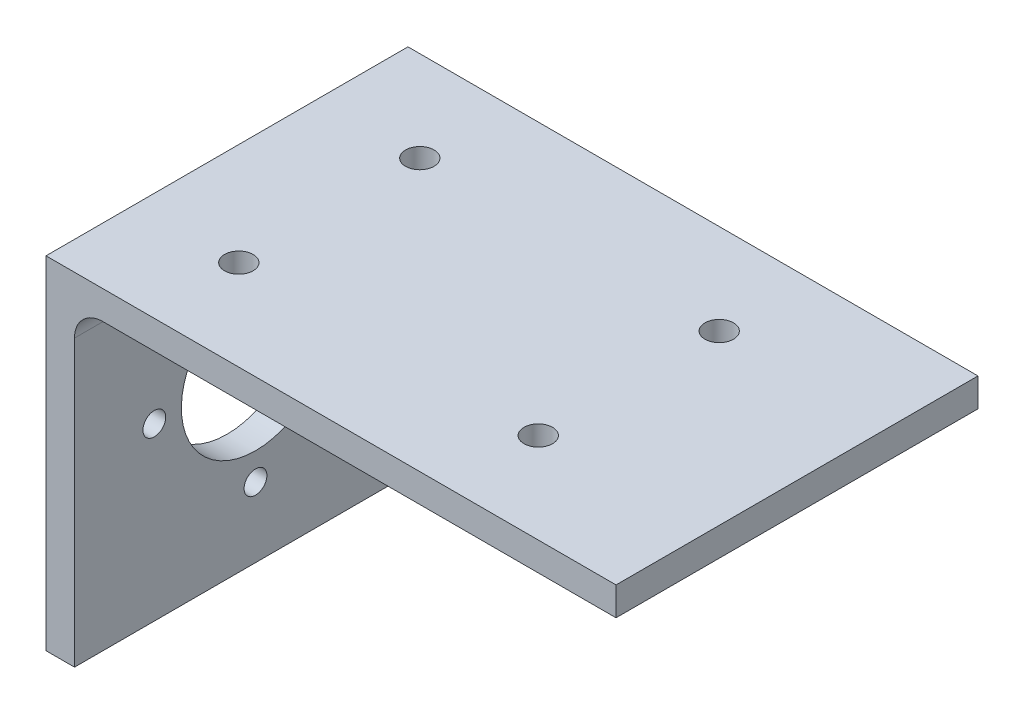
ISO-10303-21;
HEADER;
FILE_DESCRIPTION(('STEP AP214'),'2;1');
FILE_NAME('part.step','',(''),(''),'','','');
FILE_SCHEMA(('AUTOMOTIVE_DESIGN { 1 0 10303 214 1 1 1 1 }'));
ENDSEC;
DATA;
#1=APPLICATION_CONTEXT('core data for automotive mechanical design processes');
#2=APPLICATION_PROTOCOL_DEFINITION('international standard','automotive_design',2000,#1);
#3=PRODUCT_CONTEXT('',#1,'mechanical');
#4=PRODUCT('Part','Part','',(#3));
#5=PRODUCT_RELATED_PRODUCT_CATEGORY('part','',(#4));
#6=PRODUCT_DEFINITION_FORMATION('','',#4);
#7=PRODUCT_DEFINITION_CONTEXT('part definition',#1,'design');
#8=PRODUCT_DEFINITION('design','',#6,#7);
#9=PRODUCT_DEFINITION_SHAPE('','',#8);
#10=(LENGTH_UNIT() NAMED_UNIT(*) SI_UNIT(.MILLI.,.METRE.));
#11=(NAMED_UNIT(*) PLANE_ANGLE_UNIT() SI_UNIT($,.RADIAN.));
#12=(NAMED_UNIT(*) SI_UNIT($,.STERADIAN.) SOLID_ANGLE_UNIT());
#13=UNCERTAINTY_MEASURE_WITH_UNIT(LENGTH_MEASURE(1.E-05),#10,'distance_accuracy_value','');
#14=(GEOMETRIC_REPRESENTATION_CONTEXT(3) GLOBAL_UNCERTAINTY_ASSIGNED_CONTEXT((#13)) GLOBAL_UNIT_ASSIGNED_CONTEXT((#10,
#11,#12)) REPRESENTATION_CONTEXT('',''));
#15=CARTESIAN_POINT('',(0.,0.,0.));
#16=DIRECTION('',(0.,0.,1.));
#17=DIRECTION('',(1.,0.,0.));
#18=AXIS2_PLACEMENT_3D('',#15,#16,#17);
#19=CARTESIAN_POINT('',(5.,0.,63.5));
#20=DIRECTION('',(0.,1.,0.));
#21=DIRECTION('',(0.,0.,1.));
#22=AXIS2_PLACEMENT_3D('',#19,#20,#21);
#23=PLANE('',#22);
#24=DIRECTION('',(1.,0.,0.));
#25=VECTOR('',#24,1.);
#26=CARTESIAN_POINT('',(5.,0.,0.));
#27=LINE('',#26,#25);
#28=CARTESIAN_POINT('',(0.,0.,0.));
#29=VERTEX_POINT('',#28);
#30=CARTESIAN_POINT('',(5.,0.,0.));
#31=VERTEX_POINT('',#30);
#32=EDGE_CURVE('E123',#29,#31,#27,.T.);
#33=ORIENTED_EDGE('',*,*,#32,.T.);
#34=DIRECTION('',(0.,0.,-1.));
#35=VECTOR('',#34,1.);
#36=CARTESIAN_POINT('',(5.,0.,63.5));
#37=LINE('',#36,#35);
#38=CARTESIAN_POINT('',(5.,0.,63.5));
#39=VERTEX_POINT('',#38);
#40=EDGE_CURVE('E11',#39,#31,#37,.T.);
#41=ORIENTED_EDGE('',*,*,#40,.F.);
#42=DIRECTION('',(1.,0.,0.));
#43=VECTOR('',#42,1.);
#44=CARTESIAN_POINT('',(5.,0.,63.5));
#45=LINE('',#44,#43);
#46=CARTESIAN_POINT('',(0.,0.,63.5));
#47=VERTEX_POINT('',#46);
#48=EDGE_CURVE('E136',#47,#39,#45,.T.);
#49=ORIENTED_EDGE('',*,*,#48,.F.);
#50=DIRECTION('',(0.,0.,-1.));
#51=VECTOR('',#50,1.);
#52=CARTESIAN_POINT('',(0.,0.,63.5));
#53=LINE('',#52,#51);
#54=EDGE_CURVE('E119',#47,#29,#53,.T.);
#55=ORIENTED_EDGE('',*,*,#54,.T.);
#56=EDGE_LOOP('',(#33,#41,#49,#55));
#57=FACE_BOUND('',#56,.T.);
#58=ADVANCED_FACE('F33',(#57),#23,.F.);
#59=CARTESIAN_POINT('',(4.99999999999999,50.,63.5));
#60=DIRECTION('',(-1.,0.,0.));
#61=DIRECTION('',(0.,-1.,0.));
#62=AXIS2_PLACEMENT_3D('',#59,#60,#61);
#63=PLANE('',#62);
#64=CARTESIAN_POINT('',(5.,30.,49.5));
#65=DIRECTION('',(-1.,0.,0.));
#66=DIRECTION('',(0.,-1.,0.));
#67=AXIS2_PLACEMENT_3D('',#64,#65,#66);
#68=CIRCLE('',#67,2.);
#69=CARTESIAN_POINT('',(5.,28.,49.5));
#70=VERTEX_POINT('',#69);
#71=EDGE_CURVE('E162',#70,#70,#68,.T.);
#72=ORIENTED_EDGE('',*,*,#71,.T.);
#73=EDGE_LOOP('',(#72));
#74=FACE_BOUND('',#73,.T.);
#75=CARTESIAN_POINT('',(5.,12.25,31.75));
#76=DIRECTION('',(-1.,0.,0.));
#77=DIRECTION('',(0.,-1.,0.));
#78=AXIS2_PLACEMENT_3D('',#75,#76,#77);
#79=CIRCLE('',#78,2.00000000000001);
#80=CARTESIAN_POINT('',(5.,10.25,31.75));
#81=VERTEX_POINT('',#80);
#82=EDGE_CURVE('E168',#81,#81,#79,.T.);
#83=ORIENTED_EDGE('',*,*,#82,.T.);
#84=EDGE_LOOP('',(#83));
#85=FACE_BOUND('',#84,.T.);
#86=CARTESIAN_POINT('',(5.,30.,14.));
#87=DIRECTION('',(-1.,0.,0.));
#88=DIRECTION('',(0.,-1.,0.));
#89=AXIS2_PLACEMENT_3D('',#86,#87,#88);
#90=CIRCLE('',#89,2.00000000000001);
#91=CARTESIAN_POINT('',(5.,28.,14.));
#92=VERTEX_POINT('',#91);
#93=EDGE_CURVE('E169',#92,#92,#90,.T.);
#94=ORIENTED_EDGE('',*,*,#93,.T.);
#95=EDGE_LOOP('',(#94));
#96=FACE_BOUND('',#95,.T.);
#97=CARTESIAN_POINT('',(4.99999999999999,47.75,31.75));
#98=DIRECTION('',(-1.,0.,0.));
#99=DIRECTION('',(0.,-1.,0.));
#100=AXIS2_PLACEMENT_3D('',#97,#98,#99);
#101=CIRCLE('',#100,2.);
#102=CARTESIAN_POINT('',(4.99999999999999,45.75,31.75));
#103=VERTEX_POINT('',#102);
#104=EDGE_CURVE('E180',#103,#103,#101,.T.);
#105=ORIENTED_EDGE('',*,*,#104,.T.);
#106=EDGE_LOOP('',(#105));
#107=FACE_BOUND('',#106,.T.);
#108=CARTESIAN_POINT('',(5.,30.,31.75));
#109=DIRECTION('',(-1.,0.,0.));
#110=DIRECTION('',(0.,-1.,0.));
#111=AXIS2_PLACEMENT_3D('',#108,#109,#110);
#112=CIRCLE('',#111,13.);
#113=CARTESIAN_POINT('',(5.,17.,31.75));
#114=VERTEX_POINT('',#113);
#115=EDGE_CURVE('E127',#114,#114,#112,.T.);
#116=ORIENTED_EDGE('',*,*,#115,.T.);
#117=EDGE_LOOP('',(#116));
#118=FACE_BOUND('',#117,.T.);
#119=DIRECTION('',(0.,1.,0.));
#120=VECTOR('',#119,1.);
#121=CARTESIAN_POINT('',(4.99999999999999,50.,0.));
#122=LINE('',#121,#120);
#123=CARTESIAN_POINT('',(4.99999999999999,50.,0.));
#124=VERTEX_POINT('',#123);
#125=EDGE_CURVE('E126',#31,#124,#122,.T.);
#126=ORIENTED_EDGE('',*,*,#125,.T.);
#127=DIRECTION('',(0.,0.,-1.));
#128=VECTOR('',#127,1.);
#129=CARTESIAN_POINT('',(4.99999999999999,50.,63.5));
#130=LINE('',#129,#128);
#131=CARTESIAN_POINT('',(4.99999999999999,50.,63.5));
#132=VERTEX_POINT('',#131);
#133=EDGE_CURVE('E41',#132,#124,#130,.T.);
#134=ORIENTED_EDGE('',*,*,#133,.F.);
#135=DIRECTION('',(0.,1.,0.));
#136=VECTOR('',#135,1.);
#137=CARTESIAN_POINT('',(4.99999999999999,50.,63.5));
#138=LINE('',#137,#136);
#139=EDGE_CURVE('E89',#39,#132,#138,.T.);
#140=ORIENTED_EDGE('',*,*,#139,.F.);
#141=ORIENTED_EDGE('',*,*,#40,.T.);
#142=EDGE_LOOP('',(#126,#134,#140,#141));
#143=FACE_BOUND('',#142,.T.);
#144=ADVANCED_FACE('F238',(#74,#85,#96,#107,#118,#143),#63,.F.);
#145=CARTESIAN_POINT('',(9.99999999999998,50.,63.5));
#146=DIRECTION('',(0.,0.,-1.));
#147=DIRECTION('',(-1.,0.,0.));
#148=AXIS2_PLACEMENT_3D('',#145,#146,#147);
#149=CYLINDRICAL_SURFACE('',#148,4.99999999999999);
#150=CARTESIAN_POINT('',(9.99999999999998,50.,0.));
#151=DIRECTION('',(0.,0.,-1.));
#152=DIRECTION('',(1.,0.,0.));
#153=AXIS2_PLACEMENT_3D('',#150,#151,#152);
#154=CIRCLE('',#153,4.99999999999999);
#155=CARTESIAN_POINT('',(9.99999999999998,55.,0.));
#156=VERTEX_POINT('',#155);
#157=EDGE_CURVE('E129',#124,#156,#154,.T.);
#158=ORIENTED_EDGE('',*,*,#157,.T.);
#159=DIRECTION('',(0.,0.,-1.));
#160=VECTOR('',#159,1.);
#161=CARTESIAN_POINT('',(9.99999999999998,55.,63.5));
#162=LINE('',#161,#160);
#163=CARTESIAN_POINT('',(9.99999999999998,55.,63.5));
#164=VERTEX_POINT('',#163);
#165=EDGE_CURVE('E140',#164,#156,#162,.T.);
#166=ORIENTED_EDGE('',*,*,#165,.F.);
#167=CARTESIAN_POINT('',(9.99999999999998,50.,63.5));
#168=DIRECTION('',(0.,0.,-1.));
#169=DIRECTION('',(1.,0.,0.));
#170=AXIS2_PLACEMENT_3D('',#167,#168,#169);
#171=CIRCLE('',#170,4.99999999999999);
#172=EDGE_CURVE('E148',#132,#164,#171,.T.);
#173=ORIENTED_EDGE('',*,*,#172,.F.);
#174=ORIENTED_EDGE('',*,*,#133,.T.);
#175=EDGE_LOOP('',(#158,#166,#173,#174));
#176=FACE_BOUND('',#175,.T.);
#177=ADVANCED_FACE('F146',(#176),#149,.F.);
#178=CARTESIAN_POINT('',(100.,55.,63.5));
#179=DIRECTION('',(0.,1.,0.));
#180=DIRECTION('',(-1.,0.,0.));
#181=AXIS2_PLACEMENT_3D('',#178,#179,#180);
#182=PLANE('',#181);
#183=CARTESIAN_POINT('',(70.4798406497229,55.,15.875));
#184=DIRECTION('',(0.,1.,0.));
#185=DIRECTION('',(-1.,0.,0.));
#186=AXIS2_PLACEMENT_3D('',#183,#184,#185);
#187=CIRCLE('',#186,2.5);
#188=CARTESIAN_POINT('',(67.9798406497229,55.,15.875));
#189=VERTEX_POINT('',#188);
#190=EDGE_CURVE('E181',#189,#189,#187,.T.);
#191=ORIENTED_EDGE('',*,*,#190,.T.);
#192=EDGE_LOOP('',(#191));
#193=FACE_BOUND('',#192,.T.);
#194=CARTESIAN_POINT('',(17.9498406497229,55.,15.875));
#195=DIRECTION('',(0.,1.,0.));
#196=DIRECTION('',(-1.,0.,0.));
#197=AXIS2_PLACEMENT_3D('',#194,#195,#196);
#198=CIRCLE('',#197,2.5);
#199=CARTESIAN_POINT('',(15.4498406497229,55.,15.875));
#200=VERTEX_POINT('',#199);
#201=EDGE_CURVE('E191',#200,#200,#198,.T.);
#202=ORIENTED_EDGE('',*,*,#201,.T.);
#203=EDGE_LOOP('',(#202));
#204=FACE_BOUND('',#203,.T.);
#205=CARTESIAN_POINT('',(17.9498406497229,55.,47.625));
#206=DIRECTION('',(0.,1.,0.));
#207=DIRECTION('',(-1.,0.,0.));
#208=AXIS2_PLACEMENT_3D('',#205,#206,#207);
#209=CIRCLE('',#208,2.5);
#210=CARTESIAN_POINT('',(15.4498406497229,55.,47.625));
#211=VERTEX_POINT('',#210);
#212=EDGE_CURVE('E194',#211,#211,#209,.T.);
#213=ORIENTED_EDGE('',*,*,#212,.T.);
#214=EDGE_LOOP('',(#213));
#215=FACE_BOUND('',#214,.T.);
#216=CARTESIAN_POINT('',(70.4798406497229,55.,47.625));
#217=DIRECTION('',(0.,1.,0.));
#218=DIRECTION('',(-1.,0.,0.));
#219=AXIS2_PLACEMENT_3D('',#216,#217,#218);
#220=CIRCLE('',#219,2.5);
#221=CARTESIAN_POINT('',(67.9798406497229,55.,47.625));
#222=VERTEX_POINT('',#221);
#223=EDGE_CURVE('E197',#222,#222,#220,.T.);
#224=ORIENTED_EDGE('',*,*,#223,.T.);
#225=EDGE_LOOP('',(#224));
#226=FACE_BOUND('',#225,.T.);
#227=DIRECTION('',(1.,0.,0.));
#228=VECTOR('',#227,1.);
#229=CARTESIAN_POINT('',(100.,55.,0.));
#230=LINE('',#229,#228);
#231=CARTESIAN_POINT('',(100.,55.,0.));
#232=VERTEX_POINT('',#231);
#233=EDGE_CURVE('E131',#156,#232,#230,.T.);
#234=ORIENTED_EDGE('',*,*,#233,.T.);
#235=DIRECTION('',(0.,0.,-1.));
#236=VECTOR('',#235,1.);
#237=CARTESIAN_POINT('',(100.,55.,63.5));
#238=LINE('',#237,#236);
#239=CARTESIAN_POINT('',(100.,55.,63.5));
#240=VERTEX_POINT('',#239);
#241=EDGE_CURVE('E114',#240,#232,#238,.T.);
#242=ORIENTED_EDGE('',*,*,#241,.F.);
#243=DIRECTION('',(1.,0.,0.));
#244=VECTOR('',#243,1.);
#245=CARTESIAN_POINT('',(100.,55.,63.5));
#246=LINE('',#245,#244);
#247=EDGE_CURVE('E105',#164,#240,#246,.T.);
#248=ORIENTED_EDGE('',*,*,#247,.F.);
#249=ORIENTED_EDGE('',*,*,#165,.T.);
#250=EDGE_LOOP('',(#234,#242,#248,#249));
#251=FACE_BOUND('',#250,.T.);
#252=ADVANCED_FACE('F154',(#193,#204,#215,#226,#251),#182,.F.);
#253=CARTESIAN_POINT('',(100.,60.,63.5));
#254=DIRECTION('',(-1.,0.,0.));
#255=DIRECTION('',(0.,0.,1.));
#256=AXIS2_PLACEMENT_3D('',#253,#254,#255);
#257=PLANE('',#256);
#258=DIRECTION('',(0.,1.,0.));
#259=VECTOR('',#258,1.);
#260=CARTESIAN_POINT('',(100.,60.,0.));
#261=LINE('',#260,#259);
#262=CARTESIAN_POINT('',(100.,60.,0.));
#263=VERTEX_POINT('',#262);
#264=EDGE_CURVE('E113',#232,#263,#261,.T.);
#265=ORIENTED_EDGE('',*,*,#264,.T.);
#266=DIRECTION('',(0.,0.,-1.));
#267=VECTOR('',#266,1.);
#268=CARTESIAN_POINT('',(100.,60.,63.5));
#269=LINE('',#268,#267);
#270=CARTESIAN_POINT('',(100.,60.,63.5));
#271=VERTEX_POINT('',#270);
#272=EDGE_CURVE('E110',#271,#263,#269,.T.);
#273=ORIENTED_EDGE('',*,*,#272,.F.);
#274=DIRECTION('',(0.,1.,0.));
#275=VECTOR('',#274,1.);
#276=CARTESIAN_POINT('',(100.,60.,63.5));
#277=LINE('',#276,#275);
#278=EDGE_CURVE('E99',#240,#271,#277,.T.);
#279=ORIENTED_EDGE('',*,*,#278,.F.);
#280=ORIENTED_EDGE('',*,*,#241,.T.);
#281=EDGE_LOOP('',(#265,#273,#279,#280));
#282=FACE_BOUND('',#281,.T.);
#283=ADVANCED_FACE('F111',(#282),#257,.F.);
#284=CARTESIAN_POINT('',(0.,60.,63.5));
#285=DIRECTION('',(0.,-1.,0.));
#286=DIRECTION('',(0.,0.,-1.));
#287=AXIS2_PLACEMENT_3D('',#284,#285,#286);
#288=PLANE('',#287);
#289=CARTESIAN_POINT('',(70.4798406497229,60.,15.875));
#290=DIRECTION('',(0.,1.,0.));
#291=DIRECTION('',(0.,0.,-1.));
#292=AXIS2_PLACEMENT_3D('',#289,#290,#291);
#293=CIRCLE('',#292,2.5);
#294=CARTESIAN_POINT('',(70.4798406497229,60.,13.375));
#295=VERTEX_POINT('',#294);
#296=EDGE_CURVE('E204',#295,#295,#293,.T.);
#297=ORIENTED_EDGE('',*,*,#296,.F.);
#298=EDGE_LOOP('',(#297));
#299=FACE_BOUND('',#298,.T.);
#300=CARTESIAN_POINT('',(17.9498406497229,60.,15.875));
#301=DIRECTION('',(0.,1.,0.));
#302=DIRECTION('',(0.,0.,-1.));
#303=AXIS2_PLACEMENT_3D('',#300,#301,#302);
#304=CIRCLE('',#303,2.5);
#305=CARTESIAN_POINT('',(17.9498406497229,60.,13.375));
#306=VERTEX_POINT('',#305);
#307=EDGE_CURVE('E207',#306,#306,#304,.T.);
#308=ORIENTED_EDGE('',*,*,#307,.F.);
#309=EDGE_LOOP('',(#308));
#310=FACE_BOUND('',#309,.T.);
#311=CARTESIAN_POINT('',(17.9498406497229,60.,47.625));
#312=DIRECTION('',(0.,1.,0.));
#313=DIRECTION('',(0.,0.,1.));
#314=AXIS2_PLACEMENT_3D('',#311,#312,#313);
#315=CIRCLE('',#314,2.5);
#316=CARTESIAN_POINT('',(17.9498406497229,60.,50.125));
#317=VERTEX_POINT('',#316);
#318=EDGE_CURVE('E203',#317,#317,#315,.T.);
#319=ORIENTED_EDGE('',*,*,#318,.F.);
#320=EDGE_LOOP('',(#319));
#321=FACE_BOUND('',#320,.T.);
#322=CARTESIAN_POINT('',(70.4798406497229,60.,47.625));
#323=DIRECTION('',(0.,1.,0.));
#324=DIRECTION('',(0.,0.,1.));
#325=AXIS2_PLACEMENT_3D('',#322,#323,#324);
#326=CIRCLE('',#325,2.5);
#327=CARTESIAN_POINT('',(70.4798406497229,60.,50.125));
#328=VERTEX_POINT('',#327);
#329=EDGE_CURVE('E200',#328,#328,#326,.T.);
#330=ORIENTED_EDGE('',*,*,#329,.F.);
#331=EDGE_LOOP('',(#330));
#332=FACE_BOUND('',#331,.T.);
#333=DIRECTION('',(-1.,0.,0.));
#334=VECTOR('',#333,1.);
#335=CARTESIAN_POINT('',(0.,60.,0.));
#336=LINE('',#335,#334);
#337=CARTESIAN_POINT('',(0.,60.,0.));
#338=VERTEX_POINT('',#337);
#339=EDGE_CURVE('E75',#263,#338,#336,.T.);
#340=ORIENTED_EDGE('',*,*,#339,.T.);
#341=DIRECTION('',(0.,0.,-1.));
#342=VECTOR('',#341,1.);
#343=CARTESIAN_POINT('',(0.,60.,63.5));
#344=LINE('',#343,#342);
#345=CARTESIAN_POINT('',(0.,60.,63.5));
#346=VERTEX_POINT('',#345);
#347=EDGE_CURVE('E115',#346,#338,#344,.T.);
#348=ORIENTED_EDGE('',*,*,#347,.F.);
#349=DIRECTION('',(-1.,0.,0.));
#350=VECTOR('',#349,1.);
#351=CARTESIAN_POINT('',(0.,60.,63.5));
#352=LINE('',#351,#350);
#353=EDGE_CURVE('E103',#271,#346,#352,.T.);
#354=ORIENTED_EDGE('',*,*,#353,.F.);
#355=ORIENTED_EDGE('',*,*,#272,.T.);
#356=EDGE_LOOP('',(#340,#348,#354,#355));
#357=FACE_BOUND('',#356,.T.);
#358=ADVANCED_FACE('F117',(#299,#310,#321,#332,#357),#288,.F.);
#359=CARTESIAN_POINT('',(0.,0.,63.5));
#360=DIRECTION('',(1.,0.,0.));
#361=DIRECTION('',(0.,1.,0.));
#362=AXIS2_PLACEMENT_3D('',#359,#360,#361);
#363=PLANE('',#362);
#364=CARTESIAN_POINT('',(0.,30.,49.5));
#365=DIRECTION('',(-1.,0.,0.));
#366=DIRECTION('',(0.,-1.,0.));
#367=AXIS2_PLACEMENT_3D('',#364,#365,#366);
#368=CIRCLE('',#367,2.);
#369=CARTESIAN_POINT('',(0.,28.,49.5));
#370=VERTEX_POINT('',#369);
#371=EDGE_CURVE('E172',#370,#370,#368,.T.);
#372=ORIENTED_EDGE('',*,*,#371,.F.);
#373=EDGE_LOOP('',(#372));
#374=FACE_BOUND('',#373,.T.);
#375=CARTESIAN_POINT('',(0.,12.25,31.75));
#376=DIRECTION('',(-1.,0.,0.));
#377=DIRECTION('',(0.,-1.,0.));
#378=AXIS2_PLACEMENT_3D('',#375,#376,#377);
#379=CIRCLE('',#378,2.00000000000001);
#380=CARTESIAN_POINT('',(0.,10.25,31.75));
#381=VERTEX_POINT('',#380);
#382=EDGE_CURVE('E165',#381,#381,#379,.T.);
#383=ORIENTED_EDGE('',*,*,#382,.F.);
#384=EDGE_LOOP('',(#383));
#385=FACE_BOUND('',#384,.T.);
#386=CARTESIAN_POINT('',(0.,30.,14.));
#387=DIRECTION('',(-1.,0.,0.));
#388=DIRECTION('',(0.,-1.,0.));
#389=AXIS2_PLACEMENT_3D('',#386,#387,#388);
#390=CIRCLE('',#389,2.00000000000001);
#391=CARTESIAN_POINT('',(0.,28.,14.));
#392=VERTEX_POINT('',#391);
#393=EDGE_CURVE('E184',#392,#392,#390,.T.);
#394=ORIENTED_EDGE('',*,*,#393,.F.);
#395=EDGE_LOOP('',(#394));
#396=FACE_BOUND('',#395,.T.);
#397=CARTESIAN_POINT('',(0.,47.75,31.75));
#398=DIRECTION('',(-1.,0.,0.));
#399=DIRECTION('',(0.,-1.,0.));
#400=AXIS2_PLACEMENT_3D('',#397,#398,#399);
#401=CIRCLE('',#400,2.);
#402=CARTESIAN_POINT('',(0.,45.75,31.75));
#403=VERTEX_POINT('',#402);
#404=EDGE_CURVE('E177',#403,#403,#401,.T.);
#405=ORIENTED_EDGE('',*,*,#404,.F.);
#406=EDGE_LOOP('',(#405));
#407=FACE_BOUND('',#406,.T.);
#408=CARTESIAN_POINT('',(0.,30.,31.75));
#409=DIRECTION('',(-1.,0.,0.));
#410=DIRECTION('',(0.,-1.,0.));
#411=AXIS2_PLACEMENT_3D('',#408,#409,#410);
#412=CIRCLE('',#411,13.);
#413=CARTESIAN_POINT('',(0.,17.,31.75));
#414=VERTEX_POINT('',#413);
#415=EDGE_CURVE('E159',#414,#414,#412,.T.);
#416=ORIENTED_EDGE('',*,*,#415,.F.);
#417=EDGE_LOOP('',(#416));
#418=FACE_BOUND('',#417,.T.);
#419=DIRECTION('',(0.,-1.,0.));
#420=VECTOR('',#419,1.);
#421=CARTESIAN_POINT('',(0.,0.,0.));
#422=LINE('',#421,#420);
#423=EDGE_CURVE('E81',#338,#29,#422,.T.);
#424=ORIENTED_EDGE('',*,*,#423,.T.);
#425=ORIENTED_EDGE('',*,*,#54,.F.);
#426=DIRECTION('',(0.,-1.,0.));
#427=VECTOR('',#426,1.);
#428=CARTESIAN_POINT('',(0.,0.,63.5));
#429=LINE('',#428,#427);
#430=EDGE_CURVE('E49',#346,#47,#429,.T.);
#431=ORIENTED_EDGE('',*,*,#430,.F.);
#432=ORIENTED_EDGE('',*,*,#347,.T.);
#433=EDGE_LOOP('',(#424,#425,#431,#432));
#434=FACE_BOUND('',#433,.T.);
#435=ADVANCED_FACE('F218',(#374,#385,#396,#407,#418,#434),#363,.F.);
#436=CARTESIAN_POINT('',(9.99999999999998,50.,63.5));
#437=DIRECTION('',(0.,0.,1.));
#438=DIRECTION('',(1.,0.,0.));
#439=AXIS2_PLACEMENT_3D('',#436,#437,#438);
#440=PLANE('',#439);
#441=ORIENTED_EDGE('',*,*,#48,.T.);
#442=ORIENTED_EDGE('',*,*,#139,.T.);
#443=ORIENTED_EDGE('',*,*,#172,.T.);
#444=ORIENTED_EDGE('',*,*,#247,.T.);
#445=ORIENTED_EDGE('',*,*,#278,.T.);
#446=ORIENTED_EDGE('',*,*,#353,.T.);
#447=ORIENTED_EDGE('',*,*,#430,.T.);
#448=EDGE_LOOP('',(#441,#442,#443,#444,#445,#446,#447));
#449=FACE_BOUND('',#448,.T.);
#450=ADVANCED_FACE('F101',(#449),#440,.T.);
#451=CARTESIAN_POINT('',(9.99999999999998,50.,0.));
#452=DIRECTION('',(0.,0.,1.));
#453=DIRECTION('',(1.,0.,0.));
#454=AXIS2_PLACEMENT_3D('',#451,#452,#453);
#455=PLANE('',#454);
#456=ORIENTED_EDGE('',*,*,#32,.F.);
#457=ORIENTED_EDGE('',*,*,#423,.F.);
#458=ORIENTED_EDGE('',*,*,#339,.F.);
#459=ORIENTED_EDGE('',*,*,#264,.F.);
#460=ORIENTED_EDGE('',*,*,#233,.F.);
#461=ORIENTED_EDGE('',*,*,#157,.F.);
#462=ORIENTED_EDGE('',*,*,#125,.F.);
#463=EDGE_LOOP('',(#456,#457,#458,#459,#460,#461,#462));
#464=FACE_BOUND('',#463,.T.);
#465=ADVANCED_FACE('F152',(#464),#455,.F.);
#466=CARTESIAN_POINT('',(5.,30.,31.75));
#467=DIRECTION('',(-1.,0.,0.));
#468=DIRECTION('',(0.,-1.,0.));
#469=AXIS2_PLACEMENT_3D('',#466,#467,#468);
#470=CYLINDRICAL_SURFACE('',#469,13.);
#471=ORIENTED_EDGE('',*,*,#115,.F.);
#472=EDGE_LOOP('',(#471));
#473=FACE_BOUND('',#472,.T.);
#474=ORIENTED_EDGE('',*,*,#415,.T.);
#475=EDGE_LOOP('',(#474));
#476=FACE_BOUND('',#475,.T.);
#477=ADVANCED_FACE('F260',(#473,#476),#470,.F.);
#478=CARTESIAN_POINT('',(4.99999999999999,47.75,31.75));
#479=DIRECTION('',(-1.,0.,0.));
#480=DIRECTION('',(0.,-1.,0.));
#481=AXIS2_PLACEMENT_3D('',#478,#479,#480);
#482=CYLINDRICAL_SURFACE('',#481,2.);
#483=ORIENTED_EDGE('',*,*,#104,.F.);
#484=EDGE_LOOP('',(#483));
#485=FACE_BOUND('',#484,.T.);
#486=ORIENTED_EDGE('',*,*,#404,.T.);
#487=EDGE_LOOP('',(#486));
#488=FACE_BOUND('',#487,.T.);
#489=ADVANCED_FACE('F264',(#485,#488),#482,.F.);
#490=CARTESIAN_POINT('',(5.,30.,14.));
#491=DIRECTION('',(-1.,0.,0.));
#492=DIRECTION('',(0.,-1.,0.));
#493=AXIS2_PLACEMENT_3D('',#490,#491,#492);
#494=CYLINDRICAL_SURFACE('',#493,2.00000000000001);
#495=ORIENTED_EDGE('',*,*,#93,.F.);
#496=EDGE_LOOP('',(#495));
#497=FACE_BOUND('',#496,.T.);
#498=ORIENTED_EDGE('',*,*,#393,.T.);
#499=EDGE_LOOP('',(#498));
#500=FACE_BOUND('',#499,.T.);
#501=ADVANCED_FACE('F269',(#497,#500),#494,.F.);
#502=CARTESIAN_POINT('',(5.,12.25,31.75));
#503=DIRECTION('',(-1.,0.,0.));
#504=DIRECTION('',(0.,-1.,0.));
#505=AXIS2_PLACEMENT_3D('',#502,#503,#504);
#506=CYLINDRICAL_SURFACE('',#505,2.00000000000001);
#507=ORIENTED_EDGE('',*,*,#82,.F.);
#508=EDGE_LOOP('',(#507));
#509=FACE_BOUND('',#508,.T.);
#510=ORIENTED_EDGE('',*,*,#382,.T.);
#511=EDGE_LOOP('',(#510));
#512=FACE_BOUND('',#511,.T.);
#513=ADVANCED_FACE('F266',(#509,#512),#506,.F.);
#514=CARTESIAN_POINT('',(5.,30.,49.5));
#515=DIRECTION('',(-1.,0.,0.));
#516=DIRECTION('',(0.,-1.,0.));
#517=AXIS2_PLACEMENT_3D('',#514,#515,#516);
#518=CYLINDRICAL_SURFACE('',#517,2.);
#519=ORIENTED_EDGE('',*,*,#71,.F.);
#520=EDGE_LOOP('',(#519));
#521=FACE_BOUND('',#520,.T.);
#522=ORIENTED_EDGE('',*,*,#371,.T.);
#523=EDGE_LOOP('',(#522));
#524=FACE_BOUND('',#523,.T.);
#525=ADVANCED_FACE('F226',(#521,#524),#518,.F.);
#526=CARTESIAN_POINT('',(70.4798406497229,50.,47.625));
#527=DIRECTION('',(0.,1.,0.));
#528=DIRECTION('',(0.,0.,1.));
#529=AXIS2_PLACEMENT_3D('',#526,#527,#528);
#530=CYLINDRICAL_SURFACE('',#529,2.5);
#531=ORIENTED_EDGE('',*,*,#329,.T.);
#532=EDGE_LOOP('',(#531));
#533=FACE_BOUND('',#532,.T.);
#534=ORIENTED_EDGE('',*,*,#223,.F.);
#535=EDGE_LOOP('',(#534));
#536=FACE_BOUND('',#535,.T.);
#537=ADVANCED_FACE('F223',(#533,#536),#530,.F.);
#538=CARTESIAN_POINT('',(17.9498406497229,50.,47.625));
#539=DIRECTION('',(0.,1.,0.));
#540=DIRECTION('',(0.,0.,1.));
#541=AXIS2_PLACEMENT_3D('',#538,#539,#540);
#542=CYLINDRICAL_SURFACE('',#541,2.5);
#543=ORIENTED_EDGE('',*,*,#318,.T.);
#544=EDGE_LOOP('',(#543));
#545=FACE_BOUND('',#544,.T.);
#546=ORIENTED_EDGE('',*,*,#212,.F.);
#547=EDGE_LOOP('',(#546));
#548=FACE_BOUND('',#547,.T.);
#549=ADVANCED_FACE('F213',(#545,#548),#542,.F.);
#550=CARTESIAN_POINT('',(17.9498406497229,50.,15.875));
#551=DIRECTION('',(0.,1.,0.));
#552=DIRECTION('',(0.,0.,1.));
#553=AXIS2_PLACEMENT_3D('',#550,#551,#552);
#554=CYLINDRICAL_SURFACE('',#553,2.5);
#555=ORIENTED_EDGE('',*,*,#307,.T.);
#556=EDGE_LOOP('',(#555));
#557=FACE_BOUND('',#556,.T.);
#558=ORIENTED_EDGE('',*,*,#201,.F.);
#559=EDGE_LOOP('',(#558));
#560=FACE_BOUND('',#559,.T.);
#561=ADVANCED_FACE('F283',(#557,#560),#554,.F.);
#562=CARTESIAN_POINT('',(70.4798406497229,50.,15.875));
#563=DIRECTION('',(0.,1.,0.));
#564=DIRECTION('',(0.,0.,1.));
#565=AXIS2_PLACEMENT_3D('',#562,#563,#564);
#566=CYLINDRICAL_SURFACE('',#565,2.5);
#567=ORIENTED_EDGE('',*,*,#296,.T.);
#568=EDGE_LOOP('',(#567));
#569=FACE_BOUND('',#568,.T.);
#570=ORIENTED_EDGE('',*,*,#190,.F.);
#571=EDGE_LOOP('',(#570));
#572=FACE_BOUND('',#571,.T.);
#573=ADVANCED_FACE('F280',(#569,#572),#566,.F.);
#574=CLOSED_SHELL('',(#58,#144,#177,#252,#283,#358,#435,#450,#465,#477,#489,#501,#513,#525,#537,
#549,#561,#573));
#575=MANIFOLD_SOLID_BREP('B2',#574);
#576=ADVANCED_BREP_SHAPE_REPRESENTATION('',(#18,#575),#14);
#577=SHAPE_DEFINITION_REPRESENTATION(#9,#576);
ENDSEC;
END-ISO-10303-21;
